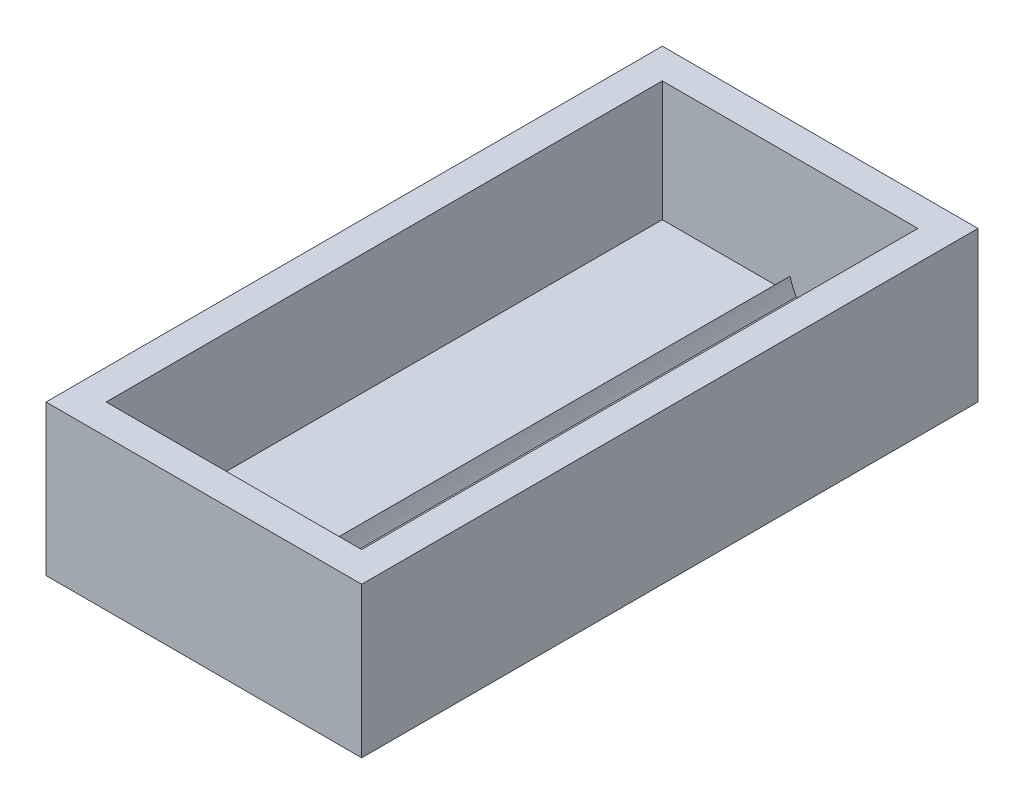
ISO-10303-21;
HEADER;
FILE_DESCRIPTION(('STEP AP214'),'2;1');
FILE_NAME('part.step','',(''),(''),'','','');
FILE_SCHEMA(('AUTOMOTIVE_DESIGN { 1 0 10303 214 1 1 1 1 }'));
ENDSEC;
DATA;
#1=APPLICATION_CONTEXT('core data for automotive mechanical design processes');
#2=APPLICATION_PROTOCOL_DEFINITION('international standard','automotive_design',2000,#1);
#3=PRODUCT_CONTEXT('',#1,'mechanical');
#4=PRODUCT('Part','Part','',(#3));
#5=PRODUCT_RELATED_PRODUCT_CATEGORY('part','',(#4));
#6=PRODUCT_DEFINITION_FORMATION('','',#4);
#7=PRODUCT_DEFINITION_CONTEXT('part definition',#1,'design');
#8=PRODUCT_DEFINITION('design','',#6,#7);
#9=PRODUCT_DEFINITION_SHAPE('','',#8);
#10=(LENGTH_UNIT() NAMED_UNIT(*) SI_UNIT(.MILLI.,.METRE.));
#11=(NAMED_UNIT(*) PLANE_ANGLE_UNIT() SI_UNIT($,.RADIAN.));
#12=(NAMED_UNIT(*) SI_UNIT($,.STERADIAN.) SOLID_ANGLE_UNIT());
#13=UNCERTAINTY_MEASURE_WITH_UNIT(LENGTH_MEASURE(1.E-05),#10,'distance_accuracy_value','');
#14=(GEOMETRIC_REPRESENTATION_CONTEXT(3) GLOBAL_UNCERTAINTY_ASSIGNED_CONTEXT((#13)) GLOBAL_UNIT_ASSIGNED_CONTEXT((#10,
#11,#12)) REPRESENTATION_CONTEXT('',''));
#15=CARTESIAN_POINT('',(0.,0.,0.));
#16=DIRECTION('',(0.,0.,1.));
#17=DIRECTION('',(1.,0.,0.));
#18=AXIS2_PLACEMENT_3D('',#15,#16,#17);
#19=CARTESIAN_POINT('',(2.54,2.54,-49.53));
#20=DIRECTION('',(0.,0.,-1.));
#21=DIRECTION('',(-1.,0.,0.));
#22=AXIS2_PLACEMENT_3D('',#19,#20,#21);
#23=PLANE('',#22);
#24=CARTESIAN_POINT('',(8.41051102671297,5.05732046883487,-49.53));
#25=DIRECTION('',(0.,0.,-1.));
#26=DIRECTION('',(-1.,0.,0.));
#27=AXIS2_PLACEMENT_3D('',#24,#25,#26);
#28=CIRCLE('',#27,5.08);
#29=CARTESIAN_POINT('',(12.8229363980009,2.54,-49.53));
#30=VERTEX_POINT('',#29);
#31=CARTESIAN_POINT('',(13.335,3.81,-49.53));
#32=VERTEX_POINT('',#31);
#33=EDGE_CURVE('E55',#30,#32,#28,.F.);
#34=ORIENTED_EDGE('',*,*,#33,.T.);
#35=CARTESIAN_POINT('',(18.259488973287,5.05732046883487,-49.53));
#36=DIRECTION('',(0.,0.,-1.));
#37=DIRECTION('',(-1.,0.,0.));
#38=AXIS2_PLACEMENT_3D('',#35,#36,#37);
#39=CIRCLE('',#38,5.08);
#40=CARTESIAN_POINT('',(13.8470636019992,2.54,-49.53));
#41=VERTEX_POINT('',#40);
#42=EDGE_CURVE('E124',#32,#41,#39,.F.);
#43=ORIENTED_EDGE('',*,*,#42,.T.);
#44=DIRECTION('',(-1.,0.,0.));
#45=VECTOR('',#44,1.);
#46=CARTESIAN_POINT('',(2.54,2.54,-49.53));
#47=LINE('',#46,#45);
#48=CARTESIAN_POINT('',(24.13,2.54,-49.53));
#49=VERTEX_POINT('',#48);
#50=EDGE_CURVE('E163',#49,#41,#47,.T.);
#51=ORIENTED_EDGE('',*,*,#50,.F.);
#52=DIRECTION('',(0.,1.,0.));
#53=VECTOR('',#52,1.);
#54=CARTESIAN_POINT('',(24.13,2.54,-49.53));
#55=LINE('',#54,#53);
#56=CARTESIAN_POINT('',(24.13,12.7,-49.53));
#57=VERTEX_POINT('',#56);
#58=EDGE_CURVE('E184',#49,#57,#55,.T.);
#59=ORIENTED_EDGE('',*,*,#58,.T.);
#60=DIRECTION('',(-1.,0.,0.));
#61=VECTOR('',#60,1.);
#62=CARTESIAN_POINT('',(2.54,12.7,-49.53));
#63=LINE('',#62,#61);
#64=CARTESIAN_POINT('',(2.54,12.7,-49.53));
#65=VERTEX_POINT('',#64);
#66=EDGE_CURVE('E154',#57,#65,#63,.T.);
#67=ORIENTED_EDGE('',*,*,#66,.T.);
#68=DIRECTION('',(0.,1.,0.));
#69=VECTOR('',#68,1.);
#70=CARTESIAN_POINT('',(2.54,2.54,-49.53));
#71=LINE('',#70,#69);
#72=CARTESIAN_POINT('',(2.54,2.54,-49.53));
#73=VERTEX_POINT('',#72);
#74=EDGE_CURVE('E180',#73,#65,#71,.T.);
#75=ORIENTED_EDGE('',*,*,#74,.F.);
#76=EDGE_CURVE('E141',#30,#73,#47,.T.);
#77=ORIENTED_EDGE('',*,*,#76,.F.);
#78=EDGE_LOOP('',(#34,#43,#51,#59,#67,#75,#77));
#79=FACE_BOUND('',#78,.T.);
#80=ADVANCED_FACE('F39',(#79),#23,.F.);
#81=CARTESIAN_POINT('',(2.54,2.54,-2.53999999999999));
#82=DIRECTION('',(0.,0.,1.));
#83=DIRECTION('',(1.,0.,0.));
#84=AXIS2_PLACEMENT_3D('',#81,#82,#83);
#85=PLANE('',#84);
#86=DIRECTION('',(1.,0.,0.));
#87=VECTOR('',#86,1.);
#88=CARTESIAN_POINT('',(2.54,2.54,-2.53999999999999));
#89=LINE('',#88,#87);
#90=CARTESIAN_POINT('',(13.8470636019992,2.54,-2.53999999999999));
#91=VERTEX_POINT('',#90);
#92=CARTESIAN_POINT('',(24.13,2.54,-2.53999999999999));
#93=VERTEX_POINT('',#92);
#94=EDGE_CURVE('E153',#91,#93,#89,.T.);
#95=ORIENTED_EDGE('',*,*,#94,.F.);
#96=CARTESIAN_POINT('',(18.259488973287,5.05732046883487,-2.53999999999999));
#97=DIRECTION('',(0.,0.,1.));
#98=DIRECTION('',(1.,0.,0.));
#99=AXIS2_PLACEMENT_3D('',#96,#97,#98);
#100=CIRCLE('',#99,5.08);
#101=CARTESIAN_POINT('',(13.335,3.81,-2.53999999999999));
#102=VERTEX_POINT('',#101);
#103=EDGE_CURVE('E132',#91,#102,#100,.F.);
#104=ORIENTED_EDGE('',*,*,#103,.T.);
#105=CARTESIAN_POINT('',(8.41051102671297,5.05732046883487,-2.53999999999999));
#106=DIRECTION('',(0.,0.,1.));
#107=DIRECTION('',(1.,0.,0.));
#108=AXIS2_PLACEMENT_3D('',#105,#106,#107);
#109=CIRCLE('',#108,5.08);
#110=CARTESIAN_POINT('',(12.8229363980009,2.54,-2.53999999999999));
#111=VERTEX_POINT('',#110);
#112=EDGE_CURVE('E136',#102,#111,#109,.F.);
#113=ORIENTED_EDGE('',*,*,#112,.T.);
#114=CARTESIAN_POINT('',(2.54,2.54,-2.53999999999999));
#115=VERTEX_POINT('',#114);
#116=EDGE_CURVE('E155',#115,#111,#89,.T.);
#117=ORIENTED_EDGE('',*,*,#116,.F.);
#118=DIRECTION('',(0.,1.,0.));
#119=VECTOR('',#118,1.);
#120=CARTESIAN_POINT('',(2.54,2.54,-2.53999999999999));
#121=LINE('',#120,#119);
#122=CARTESIAN_POINT('',(2.54,12.7,-2.53999999999999));
#123=VERTEX_POINT('',#122);
#124=EDGE_CURVE('E166',#115,#123,#121,.T.);
#125=ORIENTED_EDGE('',*,*,#124,.T.);
#126=DIRECTION('',(1.,0.,0.));
#127=VECTOR('',#126,1.);
#128=CARTESIAN_POINT('',(2.54,12.7,-2.53999999999999));
#129=LINE('',#128,#127);
#130=CARTESIAN_POINT('',(24.13,12.7,-2.53999999999999));
#131=VERTEX_POINT('',#130);
#132=EDGE_CURVE('E169',#123,#131,#129,.T.);
#133=ORIENTED_EDGE('',*,*,#132,.T.);
#134=DIRECTION('',(0.,1.,0.));
#135=VECTOR('',#134,1.);
#136=CARTESIAN_POINT('',(24.13,2.54,-2.53999999999999));
#137=LINE('',#136,#135);
#138=EDGE_CURVE('E187',#93,#131,#137,.T.);
#139=ORIENTED_EDGE('',*,*,#138,.F.);
#140=EDGE_LOOP('',(#95,#104,#113,#117,#125,#133,#139));
#141=FACE_BOUND('',#140,.T.);
#142=ADVANCED_FACE('F238',(#141),#85,.F.);
#143=CARTESIAN_POINT('',(0.,2.54,0.));
#144=DIRECTION('',(0.,-1.,0.));
#145=DIRECTION('',(0.,0.,-1.));
#146=AXIS2_PLACEMENT_3D('',#143,#144,#145);
#147=PLANE('',#146);
#148=ORIENTED_EDGE('',*,*,#50,.T.);
#149=DIRECTION('',(0.,0.,1.));
#150=VECTOR('',#149,1.);
#151=CARTESIAN_POINT('',(13.8470636019992,2.54,-52.07));
#152=LINE('',#151,#150);
#153=EDGE_CURVE('E11',#41,#91,#152,.T.);
#154=ORIENTED_EDGE('',*,*,#153,.T.);
#155=ORIENTED_EDGE('',*,*,#94,.T.);
#156=DIRECTION('',(0.,0.,-1.));
#157=VECTOR('',#156,1.);
#158=CARTESIAN_POINT('',(24.13,2.54,-2.53999999999999));
#159=LINE('',#158,#157);
#160=EDGE_CURVE('E159',#93,#49,#159,.T.);
#161=ORIENTED_EDGE('',*,*,#160,.T.);
#162=EDGE_LOOP('',(#148,#154,#155,#161));
#163=FACE_BOUND('',#162,.T.);
#164=ADVANCED_FACE('F241',(#163),#147,.F.);
#165=CARTESIAN_POINT('',(0.,12.7,0.));
#166=DIRECTION('',(1.,0.,0.));
#167=DIRECTION('',(0.,0.,-1.));
#168=AXIS2_PLACEMENT_3D('',#165,#166,#167);
#169=PLANE('',#168);
#170=DIRECTION('',(0.,0.,1.));
#171=VECTOR('',#170,1.);
#172=CARTESIAN_POINT('',(0.,0.,0.));
#173=LINE('',#172,#171);
#174=CARTESIAN_POINT('',(0.,0.,-52.07));
#175=VERTEX_POINT('',#174);
#176=CARTESIAN_POINT('',(0.,0.,0.));
#177=VERTEX_POINT('',#176);
#178=EDGE_CURVE('E183',#175,#177,#173,.T.);
#179=ORIENTED_EDGE('',*,*,#178,.T.);
#180=DIRECTION('',(0.,-1.,0.));
#181=VECTOR('',#180,1.);
#182=CARTESIAN_POINT('',(0.,12.7,0.));
#183=LINE('',#182,#181);
#184=CARTESIAN_POINT('',(0.,12.7,0.));
#185=VERTEX_POINT('',#184);
#186=EDGE_CURVE('E229',#185,#177,#183,.T.);
#187=ORIENTED_EDGE('',*,*,#186,.F.);
#188=DIRECTION('',(0.,0.,1.));
#189=VECTOR('',#188,1.);
#190=CARTESIAN_POINT('',(0.,12.7,0.));
#191=LINE('',#190,#189);
#192=CARTESIAN_POINT('',(0.,12.7,-52.07));
#193=VERTEX_POINT('',#192);
#194=EDGE_CURVE('E192',#193,#185,#191,.T.);
#195=ORIENTED_EDGE('',*,*,#194,.F.);
#196=DIRECTION('',(0.,-1.,0.));
#197=VECTOR('',#196,1.);
#198=CARTESIAN_POINT('',(0.,12.7,-52.07));
#199=LINE('',#198,#197);
#200=EDGE_CURVE('E206',#193,#175,#199,.T.);
#201=ORIENTED_EDGE('',*,*,#200,.T.);
#202=EDGE_LOOP('',(#179,#187,#195,#201));
#203=FACE_BOUND('',#202,.T.);
#204=ADVANCED_FACE('F41',(#203),#169,.F.);
#205=CARTESIAN_POINT('',(0.,12.7,0.));
#206=DIRECTION('',(0.,0.,-1.));
#207=DIRECTION('',(-1.,0.,0.));
#208=AXIS2_PLACEMENT_3D('',#205,#206,#207);
#209=PLANE('',#208);
#210=DIRECTION('',(1.,0.,0.));
#211=VECTOR('',#210,1.);
#212=CARTESIAN_POINT('',(0.,0.,0.));
#213=LINE('',#212,#211);
#214=CARTESIAN_POINT('',(26.67,0.,0.));
#215=VERTEX_POINT('',#214);
#216=EDGE_CURVE('E210',#177,#215,#213,.T.);
#217=ORIENTED_EDGE('',*,*,#216,.T.);
#218=DIRECTION('',(0.,-1.,0.));
#219=VECTOR('',#218,1.);
#220=CARTESIAN_POINT('',(26.67,12.7,0.));
#221=LINE('',#220,#219);
#222=CARTESIAN_POINT('',(26.67,12.7,0.));
#223=VERTEX_POINT('',#222);
#224=EDGE_CURVE('E225',#223,#215,#221,.T.);
#225=ORIENTED_EDGE('',*,*,#224,.F.);
#226=DIRECTION('',(1.,0.,0.));
#227=VECTOR('',#226,1.);
#228=CARTESIAN_POINT('',(0.,12.7,0.));
#229=LINE('',#228,#227);
#230=EDGE_CURVE('E196',#185,#223,#229,.T.);
#231=ORIENTED_EDGE('',*,*,#230,.F.);
#232=ORIENTED_EDGE('',*,*,#186,.T.);
#233=EDGE_LOOP('',(#217,#225,#231,#232));
#234=FACE_BOUND('',#233,.T.);
#235=ADVANCED_FACE('F317',(#234),#209,.F.);
#236=CARTESIAN_POINT('',(26.67,12.7,0.));
#237=DIRECTION('',(-1.,0.,0.));
#238=DIRECTION('',(0.,0.,1.));
#239=AXIS2_PLACEMENT_3D('',#236,#237,#238);
#240=PLANE('',#239);
#241=DIRECTION('',(0.,0.,-1.));
#242=VECTOR('',#241,1.);
#243=CARTESIAN_POINT('',(26.67,0.,0.));
#244=LINE('',#243,#242);
#245=CARTESIAN_POINT('',(26.67,0.,-52.07));
#246=VERTEX_POINT('',#245);
#247=EDGE_CURVE('E213',#215,#246,#244,.T.);
#248=ORIENTED_EDGE('',*,*,#247,.T.);
#249=DIRECTION('',(0.,-1.,0.));
#250=VECTOR('',#249,1.);
#251=CARTESIAN_POINT('',(26.67,12.7,-52.07));
#252=LINE('',#251,#250);
#253=CARTESIAN_POINT('',(26.67,12.7,-52.07));
#254=VERTEX_POINT('',#253);
#255=EDGE_CURVE('E221',#254,#246,#252,.T.);
#256=ORIENTED_EDGE('',*,*,#255,.F.);
#257=DIRECTION('',(0.,0.,-1.));
#258=VECTOR('',#257,1.);
#259=CARTESIAN_POINT('',(26.67,12.7,0.));
#260=LINE('',#259,#258);
#261=EDGE_CURVE('E200',#223,#254,#260,.T.);
#262=ORIENTED_EDGE('',*,*,#261,.F.);
#263=ORIENTED_EDGE('',*,*,#224,.T.);
#264=EDGE_LOOP('',(#248,#256,#262,#263));
#265=FACE_BOUND('',#264,.T.);
#266=ADVANCED_FACE('F322',(#265),#240,.F.);
#267=CARTESIAN_POINT('',(0.,12.7,-52.07));
#268=DIRECTION('',(0.,0.,1.));
#269=DIRECTION('',(1.,0.,0.));
#270=AXIS2_PLACEMENT_3D('',#267,#268,#269);
#271=PLANE('',#270);
#272=DIRECTION('',(-1.,0.,0.));
#273=VECTOR('',#272,1.);
#274=CARTESIAN_POINT('',(0.,0.,-52.07));
#275=LINE('',#274,#273);
#276=EDGE_CURVE('E197',#246,#175,#275,.T.);
#277=ORIENTED_EDGE('',*,*,#276,.T.);
#278=ORIENTED_EDGE('',*,*,#200,.F.);
#279=DIRECTION('',(-1.,0.,0.));
#280=VECTOR('',#279,1.);
#281=CARTESIAN_POINT('',(0.,12.7,-52.07));
#282=LINE('',#281,#280);
#283=EDGE_CURVE('E203',#254,#193,#282,.T.);
#284=ORIENTED_EDGE('',*,*,#283,.F.);
#285=ORIENTED_EDGE('',*,*,#255,.T.);
#286=EDGE_LOOP('',(#277,#278,#284,#285));
#287=FACE_BOUND('',#286,.T.);
#288=ADVANCED_FACE('F330',(#287),#271,.F.);
#289=CARTESIAN_POINT('',(0.,12.7,0.));
#290=DIRECTION('',(0.,-1.,0.));
#291=DIRECTION('',(0.,0.,-1.));
#292=AXIS2_PLACEMENT_3D('',#289,#290,#291);
#293=PLANE('',#292);
#294=ORIENTED_EDGE('',*,*,#132,.F.);
#295=DIRECTION('',(0.,0.,1.));
#296=VECTOR('',#295,1.);
#297=CARTESIAN_POINT('',(2.54,12.7,-2.53999999999999));
#298=LINE('',#297,#296);
#299=EDGE_CURVE('E63',#65,#123,#298,.T.);
#300=ORIENTED_EDGE('',*,*,#299,.F.);
#301=ORIENTED_EDGE('',*,*,#66,.F.);
#302=DIRECTION('',(0.,0.,-1.));
#303=VECTOR('',#302,1.);
#304=CARTESIAN_POINT('',(24.13,12.7,-2.53999999999999));
#305=LINE('',#304,#303);
#306=EDGE_CURVE('E173',#131,#57,#305,.T.);
#307=ORIENTED_EDGE('',*,*,#306,.F.);
#308=EDGE_LOOP('',(#294,#300,#301,#307));
#309=FACE_BOUND('',#308,.T.);
#310=ORIENTED_EDGE('',*,*,#194,.T.);
#311=ORIENTED_EDGE('',*,*,#230,.T.);
#312=ORIENTED_EDGE('',*,*,#261,.T.);
#313=ORIENTED_EDGE('',*,*,#283,.T.);
#314=EDGE_LOOP('',(#310,#311,#312,#313));
#315=FACE_BOUND('',#314,.T.);
#316=ADVANCED_FACE('F249',(#309,#315),#293,.F.);
#317=CARTESIAN_POINT('',(0.,0.,0.));
#318=DIRECTION('',(0.,-1.,0.));
#319=DIRECTION('',(0.,0.,-1.));
#320=AXIS2_PLACEMENT_3D('',#317,#318,#319);
#321=PLANE('',#320);
#322=ORIENTED_EDGE('',*,*,#178,.F.);
#323=ORIENTED_EDGE('',*,*,#276,.F.);
#324=ORIENTED_EDGE('',*,*,#247,.F.);
#325=ORIENTED_EDGE('',*,*,#216,.F.);
#326=EDGE_LOOP('',(#322,#323,#324,#325));
#327=FACE_BOUND('',#326,.T.);
#328=ADVANCED_FACE('F254',(#327),#321,.T.);
#329=CARTESIAN_POINT('',(2.54,2.54,-2.53999999999999));
#330=DIRECTION('',(-1.,0.,0.));
#331=DIRECTION('',(0.,0.,1.));
#332=AXIS2_PLACEMENT_3D('',#329,#330,#331);
#333=PLANE('',#332);
#334=ORIENTED_EDGE('',*,*,#299,.T.);
#335=ORIENTED_EDGE('',*,*,#124,.F.);
#336=DIRECTION('',(0.,0.,1.));
#337=VECTOR('',#336,1.);
#338=CARTESIAN_POINT('',(2.54,2.54,-2.53999999999999));
#339=LINE('',#338,#337);
#340=EDGE_CURVE('E149',#73,#115,#339,.T.);
#341=ORIENTED_EDGE('',*,*,#340,.F.);
#342=ORIENTED_EDGE('',*,*,#74,.T.);
#343=EDGE_LOOP('',(#334,#335,#341,#342));
#344=FACE_BOUND('',#343,.T.);
#345=ADVANCED_FACE('F252',(#344),#333,.F.);
#346=CARTESIAN_POINT('',(24.13,2.54,-2.53999999999999));
#347=DIRECTION('',(1.,0.,0.));
#348=DIRECTION('',(0.,0.,-1.));
#349=AXIS2_PLACEMENT_3D('',#346,#347,#348);
#350=PLANE('',#349);
#351=ORIENTED_EDGE('',*,*,#306,.T.);
#352=ORIENTED_EDGE('',*,*,#58,.F.);
#353=ORIENTED_EDGE('',*,*,#160,.F.);
#354=ORIENTED_EDGE('',*,*,#138,.T.);
#355=EDGE_LOOP('',(#351,#352,#353,#354));
#356=FACE_BOUND('',#355,.T.);
#357=ADVANCED_FACE('F246',(#356),#350,.F.);
#358=ORIENTED_EDGE('',*,*,#116,.T.);
#359=DIRECTION('',(0.,0.,1.));
#360=VECTOR('',#359,1.);
#361=CARTESIAN_POINT('',(12.8229363980009,2.54,-52.07));
#362=LINE('',#361,#360);
#363=EDGE_CURVE('E48',#111,#30,#362,.F.);
#364=ORIENTED_EDGE('',*,*,#363,.T.);
#365=ORIENTED_EDGE('',*,*,#76,.T.);
#366=ORIENTED_EDGE('',*,*,#340,.T.);
#367=EDGE_LOOP('',(#358,#364,#365,#366));
#368=FACE_BOUND('',#367,.T.);
#369=ADVANCED_FACE('F234',(#368),#147,.F.);
#370=CARTESIAN_POINT('',(18.259488973287,5.05732046883487,-52.07));
#371=DIRECTION('',(0.,0.,1.));
#372=DIRECTION('',(1.,0.,0.));
#373=AXIS2_PLACEMENT_3D('',#370,#371,#372);
#374=CYLINDRICAL_SURFACE('',#373,5.08);
#375=ORIENTED_EDGE('',*,*,#42,.F.);
#376=DIRECTION('',(0.,0.,1.));
#377=VECTOR('',#376,1.);
#378=CARTESIAN_POINT('',(13.335,3.81,-52.07));
#379=LINE('',#378,#377);
#380=EDGE_CURVE('E126',#32,#102,#379,.T.);
#381=ORIENTED_EDGE('',*,*,#380,.T.);
#382=ORIENTED_EDGE('',*,*,#103,.F.);
#383=ORIENTED_EDGE('',*,*,#153,.F.);
#384=EDGE_LOOP('',(#375,#381,#382,#383));
#385=FACE_BOUND('',#384,.T.);
#386=ADVANCED_FACE('F125',(#385),#374,.F.);
#387=CARTESIAN_POINT('',(8.41051102671297,5.05732046883487,-52.07));
#388=DIRECTION('',(0.,0.,1.));
#389=DIRECTION('',(1.,0.,0.));
#390=AXIS2_PLACEMENT_3D('',#387,#388,#389);
#391=CYLINDRICAL_SURFACE('',#390,5.08);
#392=ORIENTED_EDGE('',*,*,#33,.F.);
#393=ORIENTED_EDGE('',*,*,#363,.F.);
#394=ORIENTED_EDGE('',*,*,#112,.F.);
#395=ORIENTED_EDGE('',*,*,#380,.F.);
#396=EDGE_LOOP('',(#392,#393,#394,#395));
#397=FACE_BOUND('',#396,.T.);
#398=ADVANCED_FACE('F134',(#397),#391,.F.);
#399=CLOSED_SHELL('',(#80,#142,#164,#204,#235,#266,#288,#316,#328,#345,#357,#369,#386,#398));
#400=MANIFOLD_SOLID_BREP('B2',#399);
#401=ADVANCED_BREP_SHAPE_REPRESENTATION('',(#18,#400),#14);
#402=SHAPE_DEFINITION_REPRESENTATION(#9,#401);
ENDSEC;
END-ISO-10303-21;
